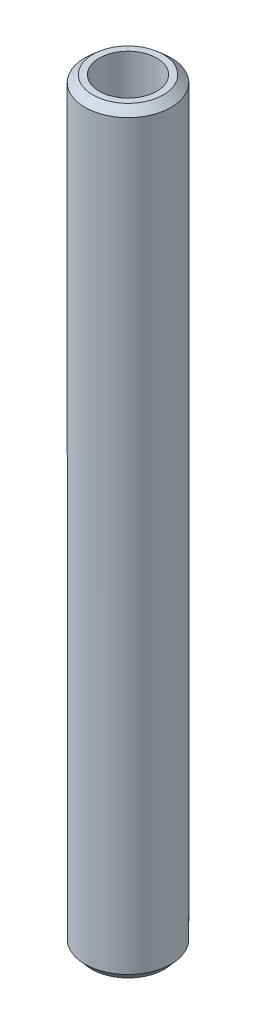
ISO-10303-21;
HEADER;
FILE_DESCRIPTION(('STEP AP214'),'2;1');
FILE_NAME('part.step','',(''),(''),'','','');
FILE_SCHEMA(('AUTOMOTIVE_DESIGN { 1 0 10303 214 1 1 1 1 }'));
ENDSEC;
DATA;
#1=APPLICATION_CONTEXT('core data for automotive mechanical design processes');
#2=APPLICATION_PROTOCOL_DEFINITION('international standard','automotive_design',2000,#1);
#3=PRODUCT_CONTEXT('',#1,'mechanical');
#4=PRODUCT('Part','Part','',(#3));
#5=PRODUCT_RELATED_PRODUCT_CATEGORY('part','',(#4));
#6=PRODUCT_DEFINITION_FORMATION('','',#4);
#7=PRODUCT_DEFINITION_CONTEXT('part definition',#1,'design');
#8=PRODUCT_DEFINITION('design','',#6,#7);
#9=PRODUCT_DEFINITION_SHAPE('','',#8);
#10=(LENGTH_UNIT() NAMED_UNIT(*) SI_UNIT(.MILLI.,.METRE.));
#11=(NAMED_UNIT(*) PLANE_ANGLE_UNIT() SI_UNIT($,.RADIAN.));
#12=(NAMED_UNIT(*) SI_UNIT($,.STERADIAN.) SOLID_ANGLE_UNIT());
#13=UNCERTAINTY_MEASURE_WITH_UNIT(LENGTH_MEASURE(1.E-05),#10,'distance_accuracy_value','');
#14=(GEOMETRIC_REPRESENTATION_CONTEXT(3) GLOBAL_UNCERTAINTY_ASSIGNED_CONTEXT((#13)) GLOBAL_UNIT_ASSIGNED_CONTEXT((#10,
#11,#12)) REPRESENTATION_CONTEXT('',''));
#15=CARTESIAN_POINT('',(0.,0.,0.));
#16=DIRECTION('',(0.,0.,1.));
#17=DIRECTION('',(1.,0.,0.));
#18=AXIS2_PLACEMENT_3D('',#15,#16,#17);
#19=CARTESIAN_POINT('',(0.,175.933963664983,0.));
#20=DIRECTION('',(0.,-1.,0.));
#21=DIRECTION('',(0.,0.,-1.));
#22=AXIS2_PLACEMENT_3D('',#19,#20,#21);
#23=CYLINDRICAL_SURFACE('',#22,10.);
#24=CARTESIAN_POINT('',(0.,174.344385377168,0.));
#25=DIRECTION('',(0.,1.,0.));
#26=DIRECTION('',(0.,0.,1.));
#27=AXIS2_PLACEMENT_3D('',#24,#25,#26);
#28=CIRCLE('',#27,10.);
#29=CARTESIAN_POINT('',(0.,174.344385377168,-10.));
#30=VERTEX_POINT('',#29);
#31=EDGE_CURVE('E50',#30,#30,#28,.F.);
#32=CARTESIAN_POINT('',(0.,1.82506192173545,0.));
#33=DIRECTION('',(0.,1.,0.));
#34=DIRECTION('',(0.,0.,1.));
#35=AXIS2_PLACEMENT_3D('',#32,#33,#34);
#36=CIRCLE('',#35,10.);
#37=CARTESIAN_POINT('',(0.,1.82506192173543,-10.));
#38=VERTEX_POINT('',#37);
#39=EDGE_CURVE('E51',#38,#38,#36,.T.);
#40=CARTESIAN_POINT('',(0.,174.344385377168,-10.));
#41=CARTESIAN_POINT('',(0.,172.547309091174,-10.));
#42=CARTESIAN_POINT('',(0.,170.75023280518,-10.));
#43=CARTESIAN_POINT('',(0.,167.156080233192,-10.));
#44=CARTESIAN_POINT('',(0.,165.359003947198,-10.));
#45=CARTESIAN_POINT('',(0.,161.764851375209,-10.));
#46=CARTESIAN_POINT('',(0.,159.967775089215,-10.));
#47=CARTESIAN_POINT('',(0.,156.373622517227,-10.));
#48=CARTESIAN_POINT('',(0.,154.576546231233,-10.));
#49=CARTESIAN_POINT('',(0.,150.982393659245,-10.));
#50=CARTESIAN_POINT('',(0.,149.185317373251,-10.));
#51=CARTESIAN_POINT('',(0.,145.591164801263,-10.));
#52=CARTESIAN_POINT('',(0.,143.794088515268,-10.));
#53=CARTESIAN_POINT('',(0.,140.19993594328,-10.));
#54=CARTESIAN_POINT('',(0.,138.402859657286,-10.));
#55=CARTESIAN_POINT('',(0.,134.808707085298,-10.));
#56=CARTESIAN_POINT('',(0.,133.011630799304,-10.));
#57=CARTESIAN_POINT('',(0.,129.417478227316,-10.));
#58=CARTESIAN_POINT('',(0.,127.620401941322,-10.));
#59=CARTESIAN_POINT('',(0.,124.026249369333,-10.));
#60=CARTESIAN_POINT('',(0.,122.229173083339,-10.));
#61=CARTESIAN_POINT('',(0.,118.635020511351,-10.));
#62=CARTESIAN_POINT('',(0.,116.837944225357,-10.));
#63=CARTESIAN_POINT('',(0.,113.243791653369,-10.));
#64=CARTESIAN_POINT('',(0.,111.446715367375,-10.));
#65=CARTESIAN_POINT('',(0.,107.852562795387,-10.));
#66=CARTESIAN_POINT('',(0.,106.055486509393,-10.));
#67=CARTESIAN_POINT('',(0.,102.461333937404,-10.));
#68=CARTESIAN_POINT('',(0.,100.66425765141,-10.));
#69=CARTESIAN_POINT('',(0.,97.0701050794221,-10.));
#70=CARTESIAN_POINT('',(0.,95.273028793428,-10.));
#71=CARTESIAN_POINT('',(0.,91.6788762214399,-10.));
#72=CARTESIAN_POINT('',(0.,89.8817999354458,-10.));
#73=CARTESIAN_POINT('',(0.,86.2876473634576,-10.));
#74=CARTESIAN_POINT('',(0.,84.4905710774635,-10.));
#75=CARTESIAN_POINT('',(0.,80.8964185054753,-10.));
#76=CARTESIAN_POINT('',(0.,79.0993422194812,-10.));
#77=CARTESIAN_POINT('',(0.,75.5051896474931,-10.));
#78=CARTESIAN_POINT('',(0.,73.708113361499,-10.));
#79=CARTESIAN_POINT('',(0.,70.1139607895108,-10.));
#80=CARTESIAN_POINT('',(0.,68.3168845035167,-10.));
#81=CARTESIAN_POINT('',(0.,64.7227319315285,-10.));
#82=CARTESIAN_POINT('',(0.,62.9256556455344,-10.));
#83=CARTESIAN_POINT('',(0.,59.3315030735463,-10.));
#84=CARTESIAN_POINT('',(0.,57.5344267875522,-10.));
#85=CARTESIAN_POINT('',(0.,53.940274215564,-10.));
#86=CARTESIAN_POINT('',(0.,52.1431979295699,-10.));
#87=CARTESIAN_POINT('',(0.,48.5490453575817,-10.));
#88=CARTESIAN_POINT('',(0.,46.7519690715877,-10.));
#89=CARTESIAN_POINT('',(0.,43.1578164995995,-10.));
#90=CARTESIAN_POINT('',(0.,41.3607402136054,-10.));
#91=CARTESIAN_POINT('',(0.,37.7665876416172,-10.));
#92=CARTESIAN_POINT('',(0.,35.9695113556231,-10.));
#93=CARTESIAN_POINT('',(0.,32.3753587836349,-10.));
#94=CARTESIAN_POINT('',(0.,30.5782824976408,-10.));
#95=CARTESIAN_POINT('',(0.,26.9841299256527,-10.));
#96=CARTESIAN_POINT('',(0.,25.1870536396586,-10.));
#97=CARTESIAN_POINT('',(0.,21.5929010676704,-10.));
#98=CARTESIAN_POINT('',(0.,19.7958247816763,-10.));
#99=CARTESIAN_POINT('',(0.,16.2016722096881,-10.));
#100=CARTESIAN_POINT('',(0.,14.404595923694,-10.));
#101=CARTESIAN_POINT('',(0.,10.8104433517059,-10.));
#102=CARTESIAN_POINT('',(0.,9.01336706571178,-10.));
#103=CARTESIAN_POINT('',(0.,5.4192144937236,-10.));
#104=CARTESIAN_POINT('',(0.,3.62213820772952,-10.));
#105=CARTESIAN_POINT('',(0.,1.82506192173543,-10.));
#106=B_SPLINE_CURVE_WITH_KNOTS('',3,(#40,#41,#42,#43,#44,#45,#46,#47,#48,#49,#50,#51,#52,#53,
#54,#55,#56,#57,#58,#59,#60,#61,#62,#63,#64,#65,#66,#67,#68,#69,#70,#71,#72,#73,#74,#75,#76,#77,
#78,#79,#80,#81,#82,#83,#84,#85,#86,#87,#88,#89,#90,#91,#92,#93,#94,#95,#96,#97,#98,#99,#100,
#101,#102,#103,#104,#105),.UNSPECIFIED.,.F.,.F.,(4,2,2,2,2,2,2,2,2,2,2,2,2,2,2,2,2,2,2,2,2,2,2,
2,2,2,2,2,2,2,2,2,4),(0.,5.39122885798229,10.7824577159646,16.1736865739468,21.5649154319291,
26.9561442899114,32.3473731478936,37.7386020058759,43.1298308638582,48.5210597218404,
53.9122885798227,59.303517437805,64.6947462957872,70.0859751537695,75.4772040117518,
80.868432869734,86.2596617277163,91.6508905856986,97.0421194436808,102.433348301663,
107.824577159645,113.215806017628,118.60703487561,123.998263733592,129.389492591574,
134.780721449557,140.171950307539,145.563179165521,150.954408023503,156.345636881486,
161.736865739468,167.12809459745,172.519323455433),.UNSPECIFIED.);
#107=EDGE_CURVE('BSEAM39',#30,#38,#106,.T.);
#108=ORIENTED_EDGE('',*,*,#31,.T.);
#109=ORIENTED_EDGE('',*,*,#39,.T.);
#110=ORIENTED_EDGE('',*,*,#107,.T.);
#111=ORIENTED_EDGE('',*,*,#107,.F.);
#112=EDGE_LOOP('',(#108,#110,#109,#111));
#113=FACE_BOUND('',#112,.T.);
#114=ADVANCED_FACE('F39',(#113),#23,.T.);
#115=CARTESIAN_POINT('',(0.,175.933963664983,0.));
#116=DIRECTION('',(0.,1.,0.));
#117=DIRECTION('',(0.,0.,1.));
#118=AXIS2_PLACEMENT_3D('',#115,#116,#117);
#119=PLANE('',#118);
#120=CARTESIAN_POINT('',(0.,175.933963664983,0.));
#121=DIRECTION('',(0.,1.,0.));
#122=DIRECTION('',(0.,0.,1.));
#123=AXIS2_PLACEMENT_3D('',#120,#121,#122);
#124=CIRCLE('',#123,8.17493807826472);
#125=CARTESIAN_POINT('',(0.,175.933963664983,8.17493807826472));
#126=VERTEX_POINT('',#125);
#127=EDGE_CURVE('E54',#126,#126,#124,.T.);
#128=ORIENTED_EDGE('',*,*,#127,.T.);
#129=EDGE_LOOP('',(#128));
#130=FACE_BOUND('',#129,.T.);
#131=CARTESIAN_POINT('',(0.,175.933963664983,0.));
#132=DIRECTION('',(0.,1.,0.));
#133=DIRECTION('',(0.,0.,1.));
#134=AXIS2_PLACEMENT_3D('',#131,#132,#133);
#135=CIRCLE('',#134,6.68210488624443);
#136=CARTESIAN_POINT('',(0.,175.933963664983,-6.68210488624443));
#137=VERTEX_POINT('',#136);
#138=EDGE_CURVE('E58',#137,#137,#135,.T.);
#139=ORIENTED_EDGE('',*,*,#138,.F.);
#140=EDGE_LOOP('',(#139));
#141=FACE_BOUND('',#140,.T.);
#142=ADVANCED_FACE('F69',(#130,#141),#119,.T.);
#143=CARTESIAN_POINT('',(0.,0.,0.));
#144=DIRECTION('',(0.,1.,0.));
#145=DIRECTION('',(0.,0.,1.));
#146=AXIS2_PLACEMENT_3D('',#143,#144,#145);
#147=PLANE('',#146);
#148=CARTESIAN_POINT('',(0.,0.,0.));
#149=DIRECTION('',(0.,1.,0.));
#150=DIRECTION('',(0.,0.,1.));
#151=AXIS2_PLACEMENT_3D('',#148,#149,#150);
#152=CIRCLE('',#151,8.41042171218512);
#153=CARTESIAN_POINT('',(0.,0.,8.41042171218512));
#154=VERTEX_POINT('',#153);
#155=EDGE_CURVE('E10',#154,#154,#152,.F.);
#156=ORIENTED_EDGE('',*,*,#155,.T.);
#157=EDGE_LOOP('',(#156));
#158=FACE_BOUND('',#157,.T.);
#159=CARTESIAN_POINT('',(0.,0.,0.));
#160=DIRECTION('',(0.,1.,0.));
#161=DIRECTION('',(0.,0.,1.));
#162=AXIS2_PLACEMENT_3D('',#159,#160,#161);
#163=CIRCLE('',#162,6.68210488624443);
#164=CARTESIAN_POINT('',(0.,0.,-6.68210488624443));
#165=VERTEX_POINT('',#164);
#166=EDGE_CURVE('E63',#165,#165,#163,.T.);
#167=ORIENTED_EDGE('',*,*,#166,.T.);
#168=EDGE_LOOP('',(#167));
#169=FACE_BOUND('',#168,.T.);
#170=ADVANCED_FACE('F75',(#158,#169),#147,.F.);
#171=CARTESIAN_POINT('',(0.,175.933963664983,0.));
#172=DIRECTION('',(0.,-1.,0.));
#173=DIRECTION('',(0.,0.,-1.));
#174=AXIS2_PLACEMENT_3D('',#171,#172,#173);
#175=CYLINDRICAL_SURFACE('',#174,6.68210488624443);
#176=CARTESIAN_POINT('',(0.,175.933963664983,-6.68210488624443));
#177=CARTESIAN_POINT('',(0.,174.101318210139,-6.68210488624443));
#178=CARTESIAN_POINT('',(0.,172.268672755296,-6.68210488624443));
#179=CARTESIAN_POINT('',(0.,168.603381845608,-6.68210488624443));
#180=CARTESIAN_POINT('',(0.,166.770736390765,-6.68210488624443));
#181=CARTESIAN_POINT('',(0.,163.105445481078,-6.68210488624443));
#182=CARTESIAN_POINT('',(0.,161.272800026234,-6.68210488624443));
#183=CARTESIAN_POINT('',(0.,157.607509116547,-6.68210488624443));
#184=CARTESIAN_POINT('',(0.,155.774863661703,-6.68210488624443));
#185=CARTESIAN_POINT('',(0.,152.109572752016,-6.68210488624443));
#186=CARTESIAN_POINT('',(0.,150.276927297173,-6.68210488624443));
#187=CARTESIAN_POINT('',(0.,146.611636387486,-6.68210488624443));
#188=CARTESIAN_POINT('',(0.,144.778990932642,-6.68210488624443));
#189=CARTESIAN_POINT('',(0.,141.113700022955,-6.68210488624443));
#190=CARTESIAN_POINT('',(0.,139.281054568111,-6.68210488624443));
#191=CARTESIAN_POINT('',(0.,135.615763658424,-6.68210488624443));
#192=CARTESIAN_POINT('',(0.,133.783118203581,-6.68210488624443));
#193=CARTESIAN_POINT('',(0.,130.117827293893,-6.68210488624443));
#194=CARTESIAN_POINT('',(0.,128.28518183905,-6.68210488624443));
#195=CARTESIAN_POINT('',(0.,124.619890929363,-6.68210488624443));
#196=CARTESIAN_POINT('',(0.,122.787245474519,-6.68210488624443));
#197=CARTESIAN_POINT('',(0.,119.121954564832,-6.68210488624443));
#198=CARTESIAN_POINT('',(0.,117.289309109988,-6.68210488624443));
#199=CARTESIAN_POINT('',(0.,113.624018200301,-6.68210488624443));
#200=CARTESIAN_POINT('',(0.,111.791372745458,-6.68210488624443));
#201=CARTESIAN_POINT('',(0.,108.126081835771,-6.68210488624443));
#202=CARTESIAN_POINT('',(0.,106.293436380927,-6.68210488624443));
#203=CARTESIAN_POINT('',(0.,102.62814547124,-6.68210488624443));
#204=CARTESIAN_POINT('',(0.,100.795500016396,-6.68210488624443));
#205=CARTESIAN_POINT('',(0.,97.1302091067092,-6.68210488624443));
#206=CARTESIAN_POINT('',(0.,95.2975636518656,-6.68210488624443));
#207=CARTESIAN_POINT('',(0.,91.6322727421785,-6.68210488624443));
#208=CARTESIAN_POINT('',(0.,89.7996272873349,-6.68210488624443));
#209=CARTESIAN_POINT('',(0.,86.1343363776478,-6.68210488624443));
#210=CARTESIAN_POINT('',(0.,84.3016909228042,-6.68210488624443));
#211=CARTESIAN_POINT('',(0.,80.6364000131171,-6.68210488624443));
#212=CARTESIAN_POINT('',(0.,78.8037545582735,-6.68210488624443));
#213=CARTESIAN_POINT('',(0.,75.1384636485864,-6.68210488624443));
#214=CARTESIAN_POINT('',(0.,73.3058181937428,-6.68210488624443));
#215=CARTESIAN_POINT('',(0.,69.6405272840556,-6.68210488624443));
#216=CARTESIAN_POINT('',(0.,67.8078818292121,-6.68210488624443));
#217=CARTESIAN_POINT('',(0.,64.1425909195249,-6.68210488624443));
#218=CARTESIAN_POINT('',(0.,62.3099454646814,-6.68210488624443));
#219=CARTESIAN_POINT('',(0.,58.6446545549942,-6.68210488624443));
#220=CARTESIAN_POINT('',(0.,56.8120091001507,-6.68210488624443));
#221=CARTESIAN_POINT('',(0.,53.1467181904635,-6.68210488624443));
#222=CARTESIAN_POINT('',(0.,51.3140727356199,-6.68210488624443));
#223=CARTESIAN_POINT('',(0.,47.6487818259328,-6.68210488624443));
#224=CARTESIAN_POINT('',(0.,45.8161363710892,-6.68210488624443));
#225=CARTESIAN_POINT('',(0.,42.1508454614021,-6.68210488624443));
#226=CARTESIAN_POINT('',(0.,40.3182000065585,-6.68210488624443));
#227=CARTESIAN_POINT('',(0.,36.6529090968714,-6.68210488624443));
#228=CARTESIAN_POINT('',(0.,34.8202636420278,-6.68210488624443));
#229=CARTESIAN_POINT('',(0.,31.1549727323407,-6.68210488624443));
#230=CARTESIAN_POINT('',(0.,29.3223272774971,-6.68210488624443));
#231=CARTESIAN_POINT('',(0.,25.65703636781,-6.68210488624443));
#232=CARTESIAN_POINT('',(0.,23.8243909129664,-6.68210488624443));
#233=CARTESIAN_POINT('',(0.,20.1591000032793,-6.68210488624443));
#234=CARTESIAN_POINT('',(0.,18.3264545484357,-6.68210488624443));
#235=CARTESIAN_POINT('',(0.,14.6611636387486,-6.68210488624443));
#236=CARTESIAN_POINT('',(0.,12.828518183905,-6.68210488624443));
#237=CARTESIAN_POINT('',(0.,9.16322727421785,-6.68210488624443));
#238=CARTESIAN_POINT('',(0.,7.33058181937428,-6.68210488624443));
#239=CARTESIAN_POINT('',(0.,3.66529090968715,-6.68210488624443));
#240=CARTESIAN_POINT('',(0.,1.83264545484357,-6.68210488624443));
#241=CARTESIAN_POINT('',(0.,0.,-6.68210488624443));
#242=B_SPLINE_CURVE_WITH_KNOTS('',3,(#176,#177,#178,#179,#180,#181,#182,#183,#184,#185,#186,
#187,#188,#189,#190,#191,#192,#193,#194,#195,#196,#197,#198,#199,#200,#201,#202,#203,#204,#205,
#206,#207,#208,#209,#210,#211,#212,#213,#214,#215,#216,#217,#218,#219,#220,#221,#222,#223,#224,
#225,#226,#227,#228,#229,#230,#231,#232,#233,#234,#235,#236,#237,#238,#239,#240,#241),
.UNSPECIFIED.,.F.,.F.,(4,2,2,2,2,2,2,2,2,2,2,2,2,2,2,2,2,2,2,2,2,2,2,2,2,2,2,2,2,2,2,2,4),(0.,
5.49793636453069,10.9958727290614,16.4938090935921,21.9917454581228,27.4896818226535,
32.9876181871842,38.4855545517149,43.9834909162456,49.4814272807764,54.9793636453071,
60.4773000098378,65.9752363743685,71.4731727388992,76.9711091034299,82.4690454679606,
87.9669818324913,93.464918197022,98.9628545615527,104.460790926083,109.958727290614,
115.456663655145,120.954600019676,126.452536384206,131.950472748737,137.448409113268,
142.946345477798,148.444281842329,153.94221820686,159.440154571391,164.938090935921,
170.436027300452,175.933963664983),.UNSPECIFIED.);
#243=EDGE_CURVE('BSEAM70',#137,#165,#242,.T.);
#244=ORIENTED_EDGE('',*,*,#138,.T.);
#245=ORIENTED_EDGE('',*,*,#166,.F.);
#246=ORIENTED_EDGE('',*,*,#243,.T.);
#247=ORIENTED_EDGE('',*,*,#243,.F.);
#248=EDGE_LOOP('',(#244,#246,#245,#247));
#249=FACE_BOUND('',#248,.T.);
#250=ADVANCED_FACE('F70',(#249),#175,.F.);
#251=CARTESIAN_POINT('',(0.,175.933963664983,0.));
#252=DIRECTION('',(0.,-1.,0.));
#253=DIRECTION('',(0.,0.,-1.));
#254=AXIS2_PLACEMENT_3D('',#251,#252,#253);
#255=CONICAL_SURFACE('',#254,8.17493807826472,0.854252089413545);
#256=ORIENTED_EDGE('',*,*,#31,.F.);
#257=EDGE_LOOP('',(#256));
#258=FACE_BOUND('',#257,.T.);
#259=ORIENTED_EDGE('',*,*,#127,.F.);
#260=EDGE_LOOP('',(#259));
#261=FACE_BOUND('',#260,.T.);
#262=ADVANCED_FACE('F81',(#258,#261),#255,.T.);
#263=CARTESIAN_POINT('',(0.,1.82506192173545,0.));
#264=DIRECTION('',(0.,1.,0.));
#265=DIRECTION('',(0.,0.,1.));
#266=AXIS2_PLACEMENT_3D('',#263,#264,#265);
#267=CONICAL_SURFACE('',#266,10.,0.716544237381363);
#268=ORIENTED_EDGE('',*,*,#155,.F.);
#269=EDGE_LOOP('',(#268));
#270=FACE_BOUND('',#269,.T.);
#271=ORIENTED_EDGE('',*,*,#39,.F.);
#272=EDGE_LOOP('',(#271));
#273=FACE_BOUND('',#272,.T.);
#274=ADVANCED_FACE('F45',(#270,#273),#267,.T.);
#275=CLOSED_SHELL('',(#114,#142,#170,#250,#262,#274));
#276=MANIFOLD_SOLID_BREP('B2',#275);
#277=ADVANCED_BREP_SHAPE_REPRESENTATION('',(#18,#276),#14);
#278=SHAPE_DEFINITION_REPRESENTATION(#9,#277);
ENDSEC;
END-ISO-10303-21;
